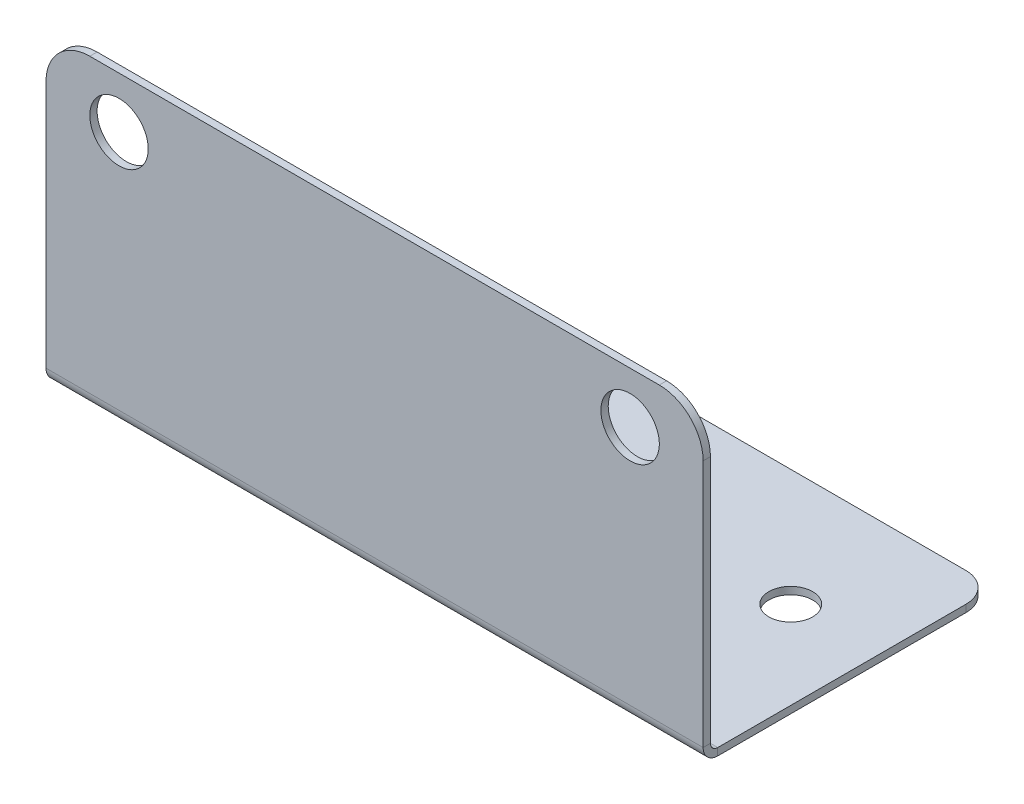
ISO-10303-21;
HEADER;
FILE_DESCRIPTION(('STEP AP214'),'2;1');
FILE_NAME('part.step','',(''),(''),'','','');
FILE_SCHEMA(('AUTOMOTIVE_DESIGN { 1 0 10303 214 1 1 1 1 }'));
ENDSEC;
DATA;
#1=APPLICATION_CONTEXT('core data for automotive mechanical design processes');
#2=APPLICATION_PROTOCOL_DEFINITION('international standard','automotive_design',2000,#1);
#3=PRODUCT_CONTEXT('',#1,'mechanical');
#4=PRODUCT('Part','Part','',(#3));
#5=PRODUCT_RELATED_PRODUCT_CATEGORY('part','',(#4));
#6=PRODUCT_DEFINITION_FORMATION('','',#4);
#7=PRODUCT_DEFINITION_CONTEXT('part definition',#1,'design');
#8=PRODUCT_DEFINITION('design','',#6,#7);
#9=PRODUCT_DEFINITION_SHAPE('','',#8);
#10=(LENGTH_UNIT() NAMED_UNIT(*) SI_UNIT(.MILLI.,.METRE.));
#11=(NAMED_UNIT(*) PLANE_ANGLE_UNIT() SI_UNIT($,.RADIAN.));
#12=(NAMED_UNIT(*) SI_UNIT($,.STERADIAN.) SOLID_ANGLE_UNIT());
#13=UNCERTAINTY_MEASURE_WITH_UNIT(LENGTH_MEASURE(1.E-05),#10,'distance_accuracy_value','');
#14=(GEOMETRIC_REPRESENTATION_CONTEXT(3) GLOBAL_UNCERTAINTY_ASSIGNED_CONTEXT((#13)) GLOBAL_UNIT_ASSIGNED_CONTEXT((#10,
#11,#12)) REPRESENTATION_CONTEXT('',''));
#15=CARTESIAN_POINT('',(0.,0.,0.));
#16=DIRECTION('',(0.,0.,1.));
#17=DIRECTION('',(1.,0.,0.));
#18=AXIS2_PLACEMENT_3D('',#15,#16,#17);
#19=CARTESIAN_POINT('',(22.5,0.5,-10.));
#20=DIRECTION('',(1.,0.,0.));
#21=DIRECTION('',(0.,0.,-1.));
#22=AXIS2_PLACEMENT_3D('',#19,#20,#21);
#23=PLANE('',#22);
#24=DIRECTION('',(0.,0.,1.));
#25=VECTOR('',#24,1.);
#26=CARTESIAN_POINT('',(22.5,0.,0.));
#27=LINE('',#26,#25);
#28=CARTESIAN_POINT('',(22.5,0.,9.));
#29=VERTEX_POINT('',#28);
#30=CARTESIAN_POINT('',(22.5,0.,-8.));
#31=VERTEX_POINT('',#30);
#32=EDGE_CURVE('E233',#29,#31,#27,.F.);
#33=ORIENTED_EDGE('',*,*,#32,.T.);
#34=DIRECTION('',(0.,1.,0.));
#35=VECTOR('',#34,1.);
#36=CARTESIAN_POINT('',(22.5,0.5,-8.));
#37=LINE('',#36,#35);
#38=CARTESIAN_POINT('',(22.5,0.5,-8.));
#39=VERTEX_POINT('',#38);
#40=EDGE_CURVE('E267',#31,#39,#37,.T.);
#41=ORIENTED_EDGE('',*,*,#40,.T.);
#42=DIRECTION('',(0.,0.,-1.));
#43=VECTOR('',#42,1.);
#44=CARTESIAN_POINT('',(22.5,0.5,-10.));
#45=LINE('',#44,#43);
#46=CARTESIAN_POINT('',(22.5,0.5,9.));
#47=VERTEX_POINT('',#46);
#48=EDGE_CURVE('E235',#47,#39,#45,.T.);
#49=ORIENTED_EDGE('',*,*,#48,.F.);
#50=DIRECTION('',(0.,-1.,0.));
#51=VECTOR('',#50,1.);
#52=CARTESIAN_POINT('',(22.5,0.499999999999999,9.));
#53=LINE('',#52,#51);
#54=EDGE_CURVE('E219',#47,#29,#53,.T.);
#55=ORIENTED_EDGE('',*,*,#54,.T.);
#56=EDGE_LOOP('',(#33,#41,#49,#55));
#57=FACE_BOUND('',#56,.T.);
#58=ADVANCED_FACE('F59',(#57),#23,.T.);
#59=CARTESIAN_POINT('',(0.,0.5,0.));
#60=DIRECTION('',(0.,1.,0.));
#61=DIRECTION('',(0.,0.,1.));
#62=AXIS2_PLACEMENT_3D('',#59,#60,#61);
#63=PLANE('',#62);
#64=CARTESIAN_POINT('',(16.5,0.5,-2.));
#65=DIRECTION('',(0.,1.,0.));
#66=DIRECTION('',(0.,0.,-1.));
#67=AXIS2_PLACEMENT_3D('',#64,#65,#66);
#68=CIRCLE('',#67,1.5);
#69=CARTESIAN_POINT('',(16.5,0.5,-3.5));
#70=VERTEX_POINT('',#69);
#71=EDGE_CURVE('E369',#70,#70,#68,.T.);
#72=ORIENTED_EDGE('',*,*,#71,.F.);
#73=EDGE_LOOP('',(#72));
#74=FACE_BOUND('',#73,.T.);
#75=CARTESIAN_POINT('',(-16.5,0.5,-2.));
#76=DIRECTION('',(0.,1.,0.));
#77=DIRECTION('',(0.,0.,1.));
#78=AXIS2_PLACEMENT_3D('',#75,#76,#77);
#79=CIRCLE('',#78,1.5);
#80=CARTESIAN_POINT('',(-16.5,0.5,-0.499999999999999));
#81=VERTEX_POINT('',#80);
#82=EDGE_CURVE('E363',#81,#81,#79,.T.);
#83=ORIENTED_EDGE('',*,*,#82,.F.);
#84=EDGE_LOOP('',(#83));
#85=FACE_BOUND('',#84,.T.);
#86=ORIENTED_EDGE('',*,*,#48,.T.);
#87=CARTESIAN_POINT('',(20.5,0.5,-8.));
#88=DIRECTION('',(0.,1.,0.));
#89=DIRECTION('',(0.,0.,1.));
#90=AXIS2_PLACEMENT_3D('',#87,#88,#89);
#91=CIRCLE('',#90,2.);
#92=CARTESIAN_POINT('',(20.5,0.5,-10.));
#93=VERTEX_POINT('',#92);
#94=EDGE_CURVE('E272',#39,#93,#91,.T.);
#95=ORIENTED_EDGE('',*,*,#94,.T.);
#96=DIRECTION('',(-1.,0.,0.));
#97=VECTOR('',#96,1.);
#98=CARTESIAN_POINT('',(-22.5,0.5,-10.));
#99=LINE('',#98,#97);
#100=CARTESIAN_POINT('',(-20.5,0.5,-10.));
#101=VERTEX_POINT('',#100);
#102=EDGE_CURVE('E238',#93,#101,#99,.T.);
#103=ORIENTED_EDGE('',*,*,#102,.T.);
#104=CARTESIAN_POINT('',(-20.5,0.5,-8.));
#105=DIRECTION('',(0.,1.,0.));
#106=DIRECTION('',(0.,0.,1.));
#107=AXIS2_PLACEMENT_3D('',#104,#105,#106);
#108=CIRCLE('',#107,2.);
#109=CARTESIAN_POINT('',(-22.5,0.5,-8.));
#110=VERTEX_POINT('',#109);
#111=EDGE_CURVE('E270',#101,#110,#108,.T.);
#112=ORIENTED_EDGE('',*,*,#111,.T.);
#113=DIRECTION('',(0.,0.,1.));
#114=VECTOR('',#113,1.);
#115=CARTESIAN_POINT('',(-22.5,0.5,-10.));
#116=LINE('',#115,#114);
#117=CARTESIAN_POINT('',(-22.5,0.5,9.));
#118=VERTEX_POINT('',#117);
#119=EDGE_CURVE('E242',#110,#118,#116,.T.);
#120=ORIENTED_EDGE('',*,*,#119,.T.);
#121=DIRECTION('',(1.,0.,0.));
#122=VECTOR('',#121,1.);
#123=CARTESIAN_POINT('',(22.5,0.499999999999999,9.));
#124=LINE('',#123,#122);
#125=CARTESIAN_POINT('',(-5.5,0.499999999999999,9.));
#126=VERTEX_POINT('',#125);
#127=EDGE_CURVE('E226',#126,#118,#124,.F.);
#128=ORIENTED_EDGE('',*,*,#127,.F.);
#129=CARTESIAN_POINT('',(-5.5,0.5,6.5));
#130=DIRECTION('',(0.,1.,0.));
#131=DIRECTION('',(0.,0.,1.));
#132=AXIS2_PLACEMENT_3D('',#129,#130,#131);
#133=CIRCLE('',#132,2.5);
#134=CARTESIAN_POINT('',(-5.5,0.5,4.));
#135=VERTEX_POINT('',#134);
#136=EDGE_CURVE('E179',#135,#126,#133,.T.);
#137=ORIENTED_EDGE('',*,*,#136,.F.);
#138=DIRECTION('',(-1.,0.,0.));
#139=VECTOR('',#138,1.);
#140=CARTESIAN_POINT('',(-5.5,0.5,4.));
#141=LINE('',#140,#139);
#142=CARTESIAN_POINT('',(5.5,0.5,4.));
#143=VERTEX_POINT('',#142);
#144=EDGE_CURVE('E202',#143,#135,#141,.T.);
#145=ORIENTED_EDGE('',*,*,#144,.F.);
#146=CARTESIAN_POINT('',(5.5,0.5,6.49999999999999));
#147=DIRECTION('',(0.,1.,0.));
#148=DIRECTION('',(0.,0.,1.));
#149=AXIS2_PLACEMENT_3D('',#146,#147,#148);
#150=CIRCLE('',#149,2.5);
#151=CARTESIAN_POINT('',(5.5,0.5,8.99999999999999));
#152=VERTEX_POINT('',#151);
#153=EDGE_CURVE('E354',#152,#143,#150,.T.);
#154=ORIENTED_EDGE('',*,*,#153,.F.);
#155=EDGE_CURVE('E223',#47,#152,#124,.F.);
#156=ORIENTED_EDGE('',*,*,#155,.F.);
#157=EDGE_LOOP('',(#86,#95,#103,#112,#120,#128,#137,#145,#154,#156));
#158=FACE_BOUND('',#157,.T.);
#159=ADVANCED_FACE('F290',(#74,#85,#158),#63,.T.);
#160=CARTESIAN_POINT('',(0.,0.,0.));
#161=DIRECTION('',(0.,1.,0.));
#162=DIRECTION('',(0.,0.,1.));
#163=AXIS2_PLACEMENT_3D('',#160,#161,#162);
#164=PLANE('',#163);
#165=CARTESIAN_POINT('',(16.5,0.,-2.));
#166=DIRECTION('',(0.,1.,0.));
#167=DIRECTION('',(0.,0.,-1.));
#168=AXIS2_PLACEMENT_3D('',#165,#166,#167);
#169=CIRCLE('',#168,1.5);
#170=CARTESIAN_POINT('',(16.5,0.,-3.5));
#171=VERTEX_POINT('',#170);
#172=EDGE_CURVE('E366',#171,#171,#169,.T.);
#173=ORIENTED_EDGE('',*,*,#172,.T.);
#174=EDGE_LOOP('',(#173));
#175=FACE_BOUND('',#174,.T.);
#176=CARTESIAN_POINT('',(-16.5,0.,-2.));
#177=DIRECTION('',(0.,1.,0.));
#178=DIRECTION('',(0.,0.,1.));
#179=AXIS2_PLACEMENT_3D('',#176,#177,#178);
#180=CIRCLE('',#179,1.5);
#181=CARTESIAN_POINT('',(-16.5,0.,-0.499999999999999));
#182=VERTEX_POINT('',#181);
#183=EDGE_CURVE('E360',#182,#182,#180,.T.);
#184=ORIENTED_EDGE('',*,*,#183,.T.);
#185=EDGE_LOOP('',(#184));
#186=FACE_BOUND('',#185,.T.);
#187=DIRECTION('',(1.,0.,0.));
#188=VECTOR('',#187,1.);
#189=CARTESIAN_POINT('',(0.,0.,-10.));
#190=LINE('',#189,#188);
#191=CARTESIAN_POINT('',(20.5,0.,-10.));
#192=VERTEX_POINT('',#191);
#193=CARTESIAN_POINT('',(-20.5,0.,-10.));
#194=VERTEX_POINT('',#193);
#195=EDGE_CURVE('E247',#192,#194,#190,.F.);
#196=ORIENTED_EDGE('',*,*,#195,.F.);
#197=CARTESIAN_POINT('',(20.5,0.,-8.));
#198=DIRECTION('',(0.,1.,0.));
#199=DIRECTION('',(0.,0.,1.));
#200=AXIS2_PLACEMENT_3D('',#197,#198,#199);
#201=CIRCLE('',#200,2.);
#202=EDGE_CURVE('E67',#192,#31,#201,.F.);
#203=ORIENTED_EDGE('',*,*,#202,.T.);
#204=ORIENTED_EDGE('',*,*,#32,.F.);
#205=DIRECTION('',(1.,0.,0.));
#206=VECTOR('',#205,1.);
#207=CARTESIAN_POINT('',(22.5,0.,9.));
#208=LINE('',#207,#206);
#209=CARTESIAN_POINT('',(5.5,0.,9.));
#210=VERTEX_POINT('',#209);
#211=EDGE_CURVE('E209',#29,#210,#208,.F.);
#212=ORIENTED_EDGE('',*,*,#211,.T.);
#213=CARTESIAN_POINT('',(5.5,0.,6.49999999999999));
#214=DIRECTION('',(0.,1.,0.));
#215=DIRECTION('',(0.,0.,1.));
#216=AXIS2_PLACEMENT_3D('',#213,#214,#215);
#217=CIRCLE('',#216,2.5);
#218=CARTESIAN_POINT('',(5.5,0.,4.));
#219=VERTEX_POINT('',#218);
#220=EDGE_CURVE('E194',#210,#219,#217,.T.);
#221=ORIENTED_EDGE('',*,*,#220,.T.);
#222=DIRECTION('',(-1.,0.,0.));
#223=VECTOR('',#222,1.);
#224=CARTESIAN_POINT('',(-5.5,0.,4.));
#225=LINE('',#224,#223);
#226=CARTESIAN_POINT('',(-5.5,0.,4.));
#227=VERTEX_POINT('',#226);
#228=EDGE_CURVE('E184',#219,#227,#225,.T.);
#229=ORIENTED_EDGE('',*,*,#228,.T.);
#230=CARTESIAN_POINT('',(-5.5,0.,6.5));
#231=DIRECTION('',(0.,1.,0.));
#232=DIRECTION('',(0.,0.,1.));
#233=AXIS2_PLACEMENT_3D('',#230,#231,#232);
#234=CIRCLE('',#233,2.5);
#235=CARTESIAN_POINT('',(-5.5,0.,9.));
#236=VERTEX_POINT('',#235);
#237=EDGE_CURVE('E176',#227,#236,#234,.T.);
#238=ORIENTED_EDGE('',*,*,#237,.T.);
#239=CARTESIAN_POINT('',(-22.5,0.,9.));
#240=VERTEX_POINT('',#239);
#241=EDGE_CURVE('E198',#236,#240,#208,.F.);
#242=ORIENTED_EDGE('',*,*,#241,.T.);
#243=DIRECTION('',(0.,0.,1.));
#244=VECTOR('',#243,1.);
#245=CARTESIAN_POINT('',(-22.5,0.,0.));
#246=LINE('',#245,#244);
#247=CARTESIAN_POINT('',(-22.5,0.,-8.));
#248=VERTEX_POINT('',#247);
#249=EDGE_CURVE('E239',#248,#240,#246,.T.);
#250=ORIENTED_EDGE('',*,*,#249,.F.);
#251=CARTESIAN_POINT('',(-20.5,0.,-8.));
#252=DIRECTION('',(0.,1.,0.));
#253=DIRECTION('',(0.,0.,1.));
#254=AXIS2_PLACEMENT_3D('',#251,#252,#253);
#255=CIRCLE('',#254,2.);
#256=EDGE_CURVE('E79',#248,#194,#255,.F.);
#257=ORIENTED_EDGE('',*,*,#256,.T.);
#258=EDGE_LOOP('',(#196,#203,#204,#212,#221,#229,#238,#242,#250,#257));
#259=FACE_BOUND('',#258,.T.);
#260=ADVANCED_FACE('F197',(#175,#186,#259),#164,.F.);
#261=CARTESIAN_POINT('',(-22.5,0.5,-10.));
#262=DIRECTION('',(-1.,0.,0.));
#263=DIRECTION('',(0.,0.,1.));
#264=AXIS2_PLACEMENT_3D('',#261,#262,#263);
#265=PLANE('',#264);
#266=ORIENTED_EDGE('',*,*,#119,.F.);
#267=DIRECTION('',(0.,1.,0.));
#268=VECTOR('',#267,1.);
#269=CARTESIAN_POINT('',(-22.5,0.5,-8.));
#270=LINE('',#269,#268);
#271=EDGE_CURVE('E13',#110,#248,#270,.F.);
#272=ORIENTED_EDGE('',*,*,#271,.T.);
#273=ORIENTED_EDGE('',*,*,#249,.T.);
#274=DIRECTION('',(0.,-1.,0.));
#275=VECTOR('',#274,1.);
#276=CARTESIAN_POINT('',(-22.5,0.499999999999999,9.));
#277=LINE('',#276,#275);
#278=EDGE_CURVE('E231',#118,#240,#277,.T.);
#279=ORIENTED_EDGE('',*,*,#278,.F.);
#280=EDGE_LOOP('',(#266,#272,#273,#279));
#281=FACE_BOUND('',#280,.T.);
#282=ADVANCED_FACE('F297',(#281),#265,.T.);
#283=CARTESIAN_POINT('',(-22.5,0.5,-10.));
#284=DIRECTION('',(0.,0.,-1.));
#285=DIRECTION('',(-1.,0.,0.));
#286=AXIS2_PLACEMENT_3D('',#283,#284,#285);
#287=PLANE('',#286);
#288=ORIENTED_EDGE('',*,*,#102,.F.);
#289=DIRECTION('',(0.,1.,0.));
#290=VECTOR('',#289,1.);
#291=CARTESIAN_POINT('',(20.5,0.5,-10.));
#292=LINE('',#291,#290);
#293=EDGE_CURVE('E277',#93,#192,#292,.F.);
#294=ORIENTED_EDGE('',*,*,#293,.T.);
#295=ORIENTED_EDGE('',*,*,#195,.T.);
#296=DIRECTION('',(0.,1.,0.));
#297=VECTOR('',#296,1.);
#298=CARTESIAN_POINT('',(-20.5,0.5,-10.));
#299=LINE('',#298,#297);
#300=EDGE_CURVE('E274',#194,#101,#299,.T.);
#301=ORIENTED_EDGE('',*,*,#300,.T.);
#302=EDGE_LOOP('',(#288,#294,#295,#301));
#303=FACE_BOUND('',#302,.T.);
#304=ADVANCED_FACE('F292',(#303),#287,.T.);
#305=CARTESIAN_POINT('',(-22.5,0.999999999999999,9.));
#306=DIRECTION('',(-1.,0.,0.));
#307=DIRECTION('',(0.,0.,1.));
#308=AXIS2_PLACEMENT_3D('',#305,#306,#307);
#309=PLANE('',#308);
#310=DIRECTION('',(0.,0.,-1.));
#311=VECTOR('',#310,1.);
#312=CARTESIAN_POINT('',(-22.5,0.999999999999999,10.));
#313=LINE('',#312,#311);
#314=CARTESIAN_POINT('',(-22.5,0.999999999999999,9.5));
#315=VERTEX_POINT('',#314);
#316=CARTESIAN_POINT('',(-22.5,0.999999999999999,10.));
#317=VERTEX_POINT('',#316);
#318=EDGE_CURVE('E217',#315,#317,#313,.F.);
#319=ORIENTED_EDGE('',*,*,#318,.F.);
#320=CARTESIAN_POINT('',(-22.5,0.999999999999999,9.));
#321=DIRECTION('',(1.,0.,0.));
#322=DIRECTION('',(0.,0.,-1.));
#323=AXIS2_PLACEMENT_3D('',#320,#321,#322);
#324=CIRCLE('',#323,0.5);
#325=EDGE_CURVE('E213',#118,#315,#324,.F.);
#326=ORIENTED_EDGE('',*,*,#325,.F.);
#327=ORIENTED_EDGE('',*,*,#278,.T.);
#328=CARTESIAN_POINT('',(-22.5,0.999999999999999,9.));
#329=DIRECTION('',(1.,0.,0.));
#330=DIRECTION('',(0.,0.,-1.));
#331=AXIS2_PLACEMENT_3D('',#328,#329,#330);
#332=CIRCLE('',#331,1.);
#333=EDGE_CURVE('E208',#240,#317,#332,.F.);
#334=ORIENTED_EDGE('',*,*,#333,.T.);
#335=EDGE_LOOP('',(#319,#326,#327,#334));
#336=FACE_BOUND('',#335,.T.);
#337=ADVANCED_FACE('F301',(#336),#309,.T.);
#338=CARTESIAN_POINT('',(22.5,0.999999999999999,9.));
#339=DIRECTION('',(-1.,0.,0.));
#340=DIRECTION('',(0.,0.,1.));
#341=AXIS2_PLACEMENT_3D('',#338,#339,#340);
#342=PLANE('',#341);
#343=CARTESIAN_POINT('',(22.5,0.999999999999999,9.));
#344=DIRECTION('',(1.,0.,0.));
#345=DIRECTION('',(0.,0.,-1.));
#346=AXIS2_PLACEMENT_3D('',#343,#344,#345);
#347=CIRCLE('',#346,0.5);
#348=CARTESIAN_POINT('',(22.5,0.999999999999999,9.5));
#349=VERTEX_POINT('',#348);
#350=EDGE_CURVE('E227',#349,#47,#347,.T.);
#351=ORIENTED_EDGE('',*,*,#350,.F.);
#352=DIRECTION('',(0.,0.,-1.));
#353=VECTOR('',#352,1.);
#354=CARTESIAN_POINT('',(22.5,0.999999999999999,9.5));
#355=LINE('',#354,#353);
#356=CARTESIAN_POINT('',(22.5,0.999999999999999,10.));
#357=VERTEX_POINT('',#356);
#358=EDGE_CURVE('E317',#349,#357,#355,.F.);
#359=ORIENTED_EDGE('',*,*,#358,.T.);
#360=CARTESIAN_POINT('',(22.5,0.999999999999999,9.));
#361=DIRECTION('',(1.,0.,0.));
#362=DIRECTION('',(0.,0.,-1.));
#363=AXIS2_PLACEMENT_3D('',#360,#361,#362);
#364=CIRCLE('',#363,1.);
#365=EDGE_CURVE('E210',#357,#29,#364,.T.);
#366=ORIENTED_EDGE('',*,*,#365,.T.);
#367=ORIENTED_EDGE('',*,*,#54,.F.);
#368=EDGE_LOOP('',(#351,#359,#366,#367));
#369=FACE_BOUND('',#368,.T.);
#370=ADVANCED_FACE('F463',(#369),#342,.F.);
#371=CARTESIAN_POINT('',(22.5,0.999999999999999,9.));
#372=DIRECTION('',(1.,0.,0.));
#373=DIRECTION('',(0.,0.,1.));
#374=AXIS2_PLACEMENT_3D('',#371,#372,#373);
#375=CYLINDRICAL_SURFACE('',#374,1.);
#376=ORIENTED_EDGE('',*,*,#211,.F.);
#377=ORIENTED_EDGE('',*,*,#365,.F.);
#378=DIRECTION('',(1.,0.,0.));
#379=VECTOR('',#378,1.);
#380=CARTESIAN_POINT('',(-22.5,0.999999999999999,10.));
#381=LINE('',#380,#379);
#382=EDGE_CURVE('E319',#357,#317,#381,.F.);
#383=ORIENTED_EDGE('',*,*,#382,.T.);
#384=ORIENTED_EDGE('',*,*,#333,.F.);
#385=ORIENTED_EDGE('',*,*,#241,.F.);
#386=DIRECTION('',(1.,0.,0.));
#387=VECTOR('',#386,1.);
#388=CARTESIAN_POINT('',(-5.5,0.,9.));
#389=LINE('',#388,#387);
#390=EDGE_CURVE('E188',#236,#210,#389,.T.);
#391=ORIENTED_EDGE('',*,*,#390,.T.);
#392=EDGE_LOOP('',(#376,#377,#383,#384,#385,#391));
#393=FACE_BOUND('',#392,.T.);
#394=ADVANCED_FACE('F205',(#393),#375,.T.);
#395=CARTESIAN_POINT('',(22.5,0.999999999999999,9.));
#396=DIRECTION('',(1.,0.,0.));
#397=DIRECTION('',(0.,0.,1.));
#398=AXIS2_PLACEMENT_3D('',#395,#396,#397);
#399=CYLINDRICAL_SURFACE('',#398,0.5);
#400=ORIENTED_EDGE('',*,*,#155,.T.);
#401=DIRECTION('',(1.,0.,0.));
#402=VECTOR('',#401,1.);
#403=CARTESIAN_POINT('',(-5.5,0.5,9.));
#404=LINE('',#403,#402);
#405=EDGE_CURVE('E357',#126,#152,#404,.T.);
#406=ORIENTED_EDGE('',*,*,#405,.F.);
#407=ORIENTED_EDGE('',*,*,#127,.T.);
#408=ORIENTED_EDGE('',*,*,#325,.T.);
#409=DIRECTION('',(1.,0.,0.));
#410=VECTOR('',#409,1.);
#411=CARTESIAN_POINT('',(-22.5,0.999999999999999,9.5));
#412=LINE('',#411,#410);
#413=EDGE_CURVE('E306',#315,#349,#412,.T.);
#414=ORIENTED_EDGE('',*,*,#413,.T.);
#415=ORIENTED_EDGE('',*,*,#350,.T.);
#416=EDGE_LOOP('',(#400,#406,#407,#408,#414,#415));
#417=FACE_BOUND('',#416,.T.);
#418=ADVANCED_FACE('F305',(#417),#399,.F.);
#419=CARTESIAN_POINT('',(-22.5,0.5,10.));
#420=DIRECTION('',(1.,0.,0.));
#421=DIRECTION('',(0.,0.,-1.));
#422=AXIS2_PLACEMENT_3D('',#419,#420,#421);
#423=PLANE('',#422);
#424=DIRECTION('',(0.,-1.,0.));
#425=VECTOR('',#424,1.);
#426=CARTESIAN_POINT('',(-22.5,0.,10.));
#427=LINE('',#426,#425);
#428=CARTESIAN_POINT('',(-22.5,18.,10.));
#429=VERTEX_POINT('',#428);
#430=EDGE_CURVE('E329',#429,#317,#427,.T.);
#431=ORIENTED_EDGE('',*,*,#430,.F.);
#432=DIRECTION('',(0.,0.,-1.));
#433=VECTOR('',#432,1.);
#434=CARTESIAN_POINT('',(-22.5,18.,10.));
#435=LINE('',#434,#433);
#436=CARTESIAN_POINT('',(-22.5,18.,9.5));
#437=VERTEX_POINT('',#436);
#438=EDGE_CURVE('E264',#429,#437,#435,.T.);
#439=ORIENTED_EDGE('',*,*,#438,.T.);
#440=DIRECTION('',(0.,1.,0.));
#441=VECTOR('',#440,1.);
#442=CARTESIAN_POINT('',(-22.5,0.5,9.5));
#443=LINE('',#442,#441);
#444=EDGE_CURVE('E314',#437,#315,#443,.F.);
#445=ORIENTED_EDGE('',*,*,#444,.T.);
#446=ORIENTED_EDGE('',*,*,#318,.T.);
#447=EDGE_LOOP('',(#431,#439,#445,#446));
#448=FACE_BOUND('',#447,.T.);
#449=ADVANCED_FACE('F489',(#448),#423,.F.);
#450=CARTESIAN_POINT('',(22.5,21.,10.));
#451=DIRECTION('',(-1.,0.,0.));
#452=DIRECTION('',(0.,-1.,0.));
#453=AXIS2_PLACEMENT_3D('',#450,#451,#452);
#454=PLANE('',#453);
#455=DIRECTION('',(0.,-1.,0.));
#456=VECTOR('',#455,1.);
#457=CARTESIAN_POINT('',(22.5,21.,9.5));
#458=LINE('',#457,#456);
#459=CARTESIAN_POINT('',(22.5,18.,9.5));
#460=VERTEX_POINT('',#459);
#461=EDGE_CURVE('E316',#349,#460,#458,.F.);
#462=ORIENTED_EDGE('',*,*,#461,.T.);
#463=DIRECTION('',(0.,0.,-1.));
#464=VECTOR('',#463,1.);
#465=CARTESIAN_POINT('',(22.5,18.,10.));
#466=LINE('',#465,#464);
#467=CARTESIAN_POINT('',(22.5,18.,10.));
#468=VERTEX_POINT('',#467);
#469=EDGE_CURVE('E258',#460,#468,#466,.F.);
#470=ORIENTED_EDGE('',*,*,#469,.T.);
#471=DIRECTION('',(0.,1.,0.));
#472=VECTOR('',#471,1.);
#473=CARTESIAN_POINT('',(22.5,0.,10.));
#474=LINE('',#473,#472);
#475=EDGE_CURVE('E331',#357,#468,#474,.T.);
#476=ORIENTED_EDGE('',*,*,#475,.F.);
#477=ORIENTED_EDGE('',*,*,#358,.F.);
#478=EDGE_LOOP('',(#462,#470,#476,#477));
#479=FACE_BOUND('',#478,.T.);
#480=ADVANCED_FACE('F498',(#479),#454,.F.);
#481=CARTESIAN_POINT('',(0.,0.,10.));
#482=DIRECTION('',(0.,0.,-1.));
#483=DIRECTION('',(-1.,0.,0.));
#484=AXIS2_PLACEMENT_3D('',#481,#482,#483);
#485=PLANE('',#484);
#486=CARTESIAN_POINT('',(17.5,17.5,10.));
#487=DIRECTION('',(0.,0.,1.));
#488=DIRECTION('',(-1.,0.,0.));
#489=AXIS2_PLACEMENT_3D('',#486,#487,#488);
#490=CIRCLE('',#489,2.00000000000001);
#491=CARTESIAN_POINT('',(15.5,17.5,10.));
#492=VERTEX_POINT('',#491);
#493=EDGE_CURVE('E342',#492,#492,#490,.T.);
#494=ORIENTED_EDGE('',*,*,#493,.F.);
#495=EDGE_LOOP('',(#494));
#496=FACE_BOUND('',#495,.T.);
#497=CARTESIAN_POINT('',(-17.5,17.5,10.));
#498=DIRECTION('',(0.,0.,1.));
#499=DIRECTION('',(1.,0.,0.));
#500=AXIS2_PLACEMENT_3D('',#497,#498,#499);
#501=CIRCLE('',#500,2.);
#502=CARTESIAN_POINT('',(-15.5,17.5,10.));
#503=VERTEX_POINT('',#502);
#504=EDGE_CURVE('E336',#503,#503,#501,.T.);
#505=ORIENTED_EDGE('',*,*,#504,.F.);
#506=EDGE_LOOP('',(#505));
#507=FACE_BOUND('',#506,.T.);
#508=ORIENTED_EDGE('',*,*,#475,.T.);
#509=CARTESIAN_POINT('',(19.5,18.,10.));
#510=DIRECTION('',(0.,0.,-1.));
#511=DIRECTION('',(-1.,0.,0.));
#512=AXIS2_PLACEMENT_3D('',#509,#510,#511);
#513=CIRCLE('',#512,3.);
#514=CARTESIAN_POINT('',(19.5,21.,10.));
#515=VERTEX_POINT('',#514);
#516=EDGE_CURVE('E262',#468,#515,#513,.F.);
#517=ORIENTED_EDGE('',*,*,#516,.T.);
#518=DIRECTION('',(-1.,0.,0.));
#519=VECTOR('',#518,1.);
#520=CARTESIAN_POINT('',(0.,21.,10.));
#521=LINE('',#520,#519);
#522=CARTESIAN_POINT('',(-19.5,21.,10.));
#523=VERTEX_POINT('',#522);
#524=EDGE_CURVE('E230',#515,#523,#521,.T.);
#525=ORIENTED_EDGE('',*,*,#524,.T.);
#526=CARTESIAN_POINT('',(-19.5,18.,10.));
#527=DIRECTION('',(0.,0.,-1.));
#528=DIRECTION('',(-1.,0.,0.));
#529=AXIS2_PLACEMENT_3D('',#526,#527,#528);
#530=CIRCLE('',#529,3.);
#531=EDGE_CURVE('E260',#523,#429,#530,.F.);
#532=ORIENTED_EDGE('',*,*,#531,.T.);
#533=ORIENTED_EDGE('',*,*,#430,.T.);
#534=ORIENTED_EDGE('',*,*,#382,.F.);
#535=EDGE_LOOP('',(#508,#517,#525,#532,#533,#534));
#536=FACE_BOUND('',#535,.T.);
#537=ADVANCED_FACE('F508',(#496,#507,#536),#485,.F.);
#538=CARTESIAN_POINT('',(0.,0.,9.5));
#539=DIRECTION('',(0.,0.,-1.));
#540=DIRECTION('',(-1.,0.,0.));
#541=AXIS2_PLACEMENT_3D('',#538,#539,#540);
#542=PLANE('',#541);
#543=CARTESIAN_POINT('',(17.5,17.5,9.5));
#544=DIRECTION('',(0.,0.,1.));
#545=DIRECTION('',(-1.,0.,0.));
#546=AXIS2_PLACEMENT_3D('',#543,#544,#545);
#547=CIRCLE('',#546,2.00000000000001);
#548=CARTESIAN_POINT('',(15.5,17.5,9.5));
#549=VERTEX_POINT('',#548);
#550=EDGE_CURVE('E339',#549,#549,#547,.T.);
#551=ORIENTED_EDGE('',*,*,#550,.T.);
#552=EDGE_LOOP('',(#551));
#553=FACE_BOUND('',#552,.T.);
#554=CARTESIAN_POINT('',(-17.5,17.5,9.5));
#555=DIRECTION('',(0.,0.,1.));
#556=DIRECTION('',(1.,0.,0.));
#557=AXIS2_PLACEMENT_3D('',#554,#555,#556);
#558=CIRCLE('',#557,2.);
#559=CARTESIAN_POINT('',(-15.5,17.5,9.5));
#560=VERTEX_POINT('',#559);
#561=EDGE_CURVE('E321',#560,#560,#558,.T.);
#562=ORIENTED_EDGE('',*,*,#561,.T.);
#563=EDGE_LOOP('',(#562));
#564=FACE_BOUND('',#563,.T.);
#565=DIRECTION('',(1.,0.,0.));
#566=VECTOR('',#565,1.);
#567=CARTESIAN_POINT('',(-22.5,21.,9.5));
#568=LINE('',#567,#566);
#569=CARTESIAN_POINT('',(19.5,21.,9.5));
#570=VERTEX_POINT('',#569);
#571=CARTESIAN_POINT('',(-19.5,21.,9.5));
#572=VERTEX_POINT('',#571);
#573=EDGE_CURVE('E326',#570,#572,#568,.F.);
#574=ORIENTED_EDGE('',*,*,#573,.F.);
#575=CARTESIAN_POINT('',(19.5,18.,9.5));
#576=DIRECTION('',(0.,0.,-1.));
#577=DIRECTION('',(-1.,0.,0.));
#578=AXIS2_PLACEMENT_3D('',#575,#576,#577);
#579=CIRCLE('',#578,3.);
#580=EDGE_CURVE('E256',#570,#460,#579,.T.);
#581=ORIENTED_EDGE('',*,*,#580,.T.);
#582=ORIENTED_EDGE('',*,*,#461,.F.);
#583=ORIENTED_EDGE('',*,*,#413,.F.);
#584=ORIENTED_EDGE('',*,*,#444,.F.);
#585=CARTESIAN_POINT('',(-19.5,18.,9.5));
#586=DIRECTION('',(0.,0.,-1.));
#587=DIRECTION('',(-1.,0.,0.));
#588=AXIS2_PLACEMENT_3D('',#585,#586,#587);
#589=CIRCLE('',#588,3.);
#590=EDGE_CURVE('E254',#437,#572,#589,.T.);
#591=ORIENTED_EDGE('',*,*,#590,.T.);
#592=EDGE_LOOP('',(#574,#581,#582,#583,#584,#591));
#593=FACE_BOUND('',#592,.T.);
#594=ADVANCED_FACE('F313',(#553,#564,#593),#542,.T.);
#595=CARTESIAN_POINT('',(-22.5,21.,10.));
#596=DIRECTION('',(0.,-1.,0.));
#597=DIRECTION('',(0.,0.,-1.));
#598=AXIS2_PLACEMENT_3D('',#595,#596,#597);
#599=PLANE('',#598);
#600=ORIENTED_EDGE('',*,*,#524,.F.);
#601=DIRECTION('',(0.,0.,-1.));
#602=VECTOR('',#601,1.);
#603=CARTESIAN_POINT('',(19.5,21.,10.));
#604=LINE('',#603,#602);
#605=EDGE_CURVE('E251',#515,#570,#604,.T.);
#606=ORIENTED_EDGE('',*,*,#605,.T.);
#607=ORIENTED_EDGE('',*,*,#573,.T.);
#608=DIRECTION('',(0.,0.,-1.));
#609=VECTOR('',#608,1.);
#610=CARTESIAN_POINT('',(-19.5,21.,10.));
#611=LINE('',#610,#609);
#612=EDGE_CURVE('E244',#572,#523,#611,.F.);
#613=ORIENTED_EDGE('',*,*,#612,.T.);
#614=EDGE_LOOP('',(#600,#606,#607,#613));
#615=FACE_BOUND('',#614,.T.);
#616=ADVANCED_FACE('F527',(#615),#599,.F.);
#617=CARTESIAN_POINT('',(-17.5,17.5,9.5));
#618=DIRECTION('',(0.,0.,1.));
#619=DIRECTION('',(1.,0.,0.));
#620=AXIS2_PLACEMENT_3D('',#617,#618,#619);
#621=CYLINDRICAL_SURFACE('',#620,2.);
#622=ORIENTED_EDGE('',*,*,#561,.F.);
#623=EDGE_LOOP('',(#622));
#624=FACE_BOUND('',#623,.T.);
#625=ORIENTED_EDGE('',*,*,#504,.T.);
#626=EDGE_LOOP('',(#625));
#627=FACE_BOUND('',#626,.T.);
#628=ADVANCED_FACE('F537',(#624,#627),#621,.F.);
#629=CARTESIAN_POINT('',(17.5,17.5,9.5));
#630=DIRECTION('',(0.,0.,1.));
#631=DIRECTION('',(1.,0.,0.));
#632=AXIS2_PLACEMENT_3D('',#629,#630,#631);
#633=CYLINDRICAL_SURFACE('',#632,2.00000000000001);
#634=ORIENTED_EDGE('',*,*,#550,.F.);
#635=EDGE_LOOP('',(#634));
#636=FACE_BOUND('',#635,.T.);
#637=ORIENTED_EDGE('',*,*,#493,.T.);
#638=EDGE_LOOP('',(#637));
#639=FACE_BOUND('',#638,.T.);
#640=ADVANCED_FACE('F547',(#636,#639),#633,.F.);
#641=CARTESIAN_POINT('',(-5.5,0.,6.5));
#642=DIRECTION('',(0.,1.,0.));
#643=DIRECTION('',(0.,0.,1.));
#644=AXIS2_PLACEMENT_3D('',#641,#642,#643);
#645=CYLINDRICAL_SURFACE('',#644,2.5);
#646=ORIENTED_EDGE('',*,*,#136,.T.);
#647=DIRECTION('',(0.,1.,0.));
#648=VECTOR('',#647,1.);
#649=CARTESIAN_POINT('',(-5.5,0.,9.));
#650=LINE('',#649,#648);
#651=EDGE_CURVE('E172',#236,#126,#650,.T.);
#652=ORIENTED_EDGE('',*,*,#651,.F.);
#653=ORIENTED_EDGE('',*,*,#237,.F.);
#654=DIRECTION('',(0.,1.,0.));
#655=VECTOR('',#654,1.);
#656=CARTESIAN_POINT('',(-5.5,0.,4.));
#657=LINE('',#656,#655);
#658=EDGE_CURVE('E345',#227,#135,#657,.T.);
#659=ORIENTED_EDGE('',*,*,#658,.T.);
#660=EDGE_LOOP('',(#646,#652,#653,#659));
#661=FACE_BOUND('',#660,.T.);
#662=ADVANCED_FACE('F174',(#661),#645,.F.);
#663=CARTESIAN_POINT('',(-5.5,0.,4.));
#664=DIRECTION('',(0.,0.,-1.));
#665=DIRECTION('',(-1.,0.,0.));
#666=AXIS2_PLACEMENT_3D('',#663,#664,#665);
#667=PLANE('',#666);
#668=ORIENTED_EDGE('',*,*,#144,.T.);
#669=ORIENTED_EDGE('',*,*,#658,.F.);
#670=ORIENTED_EDGE('',*,*,#228,.F.);
#671=DIRECTION('',(0.,1.,0.));
#672=VECTOR('',#671,1.);
#673=CARTESIAN_POINT('',(5.5,0.,4.));
#674=LINE('',#673,#672);
#675=EDGE_CURVE('E349',#219,#143,#674,.T.);
#676=ORIENTED_EDGE('',*,*,#675,.T.);
#677=EDGE_LOOP('',(#668,#669,#670,#676));
#678=FACE_BOUND('',#677,.T.);
#679=ADVANCED_FACE('F566',(#678),#667,.F.);
#680=CARTESIAN_POINT('',(5.5,0.,6.49999999999999));
#681=DIRECTION('',(0.,1.,0.));
#682=DIRECTION('',(0.,0.,1.));
#683=AXIS2_PLACEMENT_3D('',#680,#681,#682);
#684=CYLINDRICAL_SURFACE('',#683,2.5);
#685=ORIENTED_EDGE('',*,*,#153,.T.);
#686=ORIENTED_EDGE('',*,*,#675,.F.);
#687=ORIENTED_EDGE('',*,*,#220,.F.);
#688=DIRECTION('',(0.,1.,0.));
#689=VECTOR('',#688,1.);
#690=CARTESIAN_POINT('',(5.5,0.,8.99999999999999));
#691=LINE('',#690,#689);
#692=EDGE_CURVE('E183',#210,#152,#691,.T.);
#693=ORIENTED_EDGE('',*,*,#692,.T.);
#694=EDGE_LOOP('',(#685,#686,#687,#693));
#695=FACE_BOUND('',#694,.T.);
#696=ADVANCED_FACE('F396',(#695),#684,.F.);
#697=CARTESIAN_POINT('',(-5.5,0.,9.));
#698=DIRECTION('',(0.,0.,1.));
#699=DIRECTION('',(1.,0.,0.));
#700=AXIS2_PLACEMENT_3D('',#697,#698,#699);
#701=PLANE('',#700);
#702=ORIENTED_EDGE('',*,*,#405,.T.);
#703=ORIENTED_EDGE('',*,*,#692,.F.);
#704=ORIENTED_EDGE('',*,*,#390,.F.);
#705=ORIENTED_EDGE('',*,*,#651,.T.);
#706=EDGE_LOOP('',(#702,#703,#704,#705));
#707=FACE_BOUND('',#706,.T.);
#708=ADVANCED_FACE('F189',(#707),#701,.F.);
#709=CARTESIAN_POINT('',(-16.5,0.,-2.));
#710=DIRECTION('',(0.,1.,0.));
#711=DIRECTION('',(0.,0.,1.));
#712=AXIS2_PLACEMENT_3D('',#709,#710,#711);
#713=CYLINDRICAL_SURFACE('',#712,1.5);
#714=ORIENTED_EDGE('',*,*,#183,.F.);
#715=EDGE_LOOP('',(#714));
#716=FACE_BOUND('',#715,.T.);
#717=ORIENTED_EDGE('',*,*,#82,.T.);
#718=EDGE_LOOP('',(#717));
#719=FACE_BOUND('',#718,.T.);
#720=ADVANCED_FACE('F381',(#716,#719),#713,.F.);
#721=CARTESIAN_POINT('',(16.5,0.,-2.));
#722=DIRECTION('',(0.,1.,0.));
#723=DIRECTION('',(0.,0.,1.));
#724=AXIS2_PLACEMENT_3D('',#721,#722,#723);
#725=CYLINDRICAL_SURFACE('',#724,1.5);
#726=ORIENTED_EDGE('',*,*,#172,.F.);
#727=EDGE_LOOP('',(#726));
#728=FACE_BOUND('',#727,.T.);
#729=ORIENTED_EDGE('',*,*,#71,.T.);
#730=EDGE_LOOP('',(#729));
#731=FACE_BOUND('',#730,.T.);
#732=ADVANCED_FACE('F377',(#728,#731),#725,.F.);
#733=CARTESIAN_POINT('',(19.5,18.,10.));
#734=DIRECTION('',(0.,0.,-1.));
#735=DIRECTION('',(-1.,0.,0.));
#736=AXIS2_PLACEMENT_3D('',#733,#734,#735);
#737=CYLINDRICAL_SURFACE('',#736,3.);
#738=ORIENTED_EDGE('',*,*,#516,.F.);
#739=ORIENTED_EDGE('',*,*,#469,.F.);
#740=ORIENTED_EDGE('',*,*,#580,.F.);
#741=ORIENTED_EDGE('',*,*,#605,.F.);
#742=EDGE_LOOP('',(#738,#739,#740,#741));
#743=FACE_BOUND('',#742,.T.);
#744=ADVANCED_FACE('F380',(#743),#737,.T.);
#745=CARTESIAN_POINT('',(-19.5,18.,10.));
#746=DIRECTION('',(0.,0.,-1.));
#747=DIRECTION('',(-1.,0.,0.));
#748=AXIS2_PLACEMENT_3D('',#745,#746,#747);
#749=CYLINDRICAL_SURFACE('',#748,3.);
#750=ORIENTED_EDGE('',*,*,#531,.F.);
#751=ORIENTED_EDGE('',*,*,#612,.F.);
#752=ORIENTED_EDGE('',*,*,#590,.F.);
#753=ORIENTED_EDGE('',*,*,#438,.F.);
#754=EDGE_LOOP('',(#750,#751,#752,#753));
#755=FACE_BOUND('',#754,.T.);
#756=ADVANCED_FACE('F413',(#755),#749,.T.);
#757=CARTESIAN_POINT('',(20.5,0.5,-8.));
#758=DIRECTION('',(0.,1.,0.));
#759=DIRECTION('',(0.,0.,1.));
#760=AXIS2_PLACEMENT_3D('',#757,#758,#759);
#761=CYLINDRICAL_SURFACE('',#760,2.);
#762=ORIENTED_EDGE('',*,*,#202,.F.);
#763=ORIENTED_EDGE('',*,*,#293,.F.);
#764=ORIENTED_EDGE('',*,*,#94,.F.);
#765=ORIENTED_EDGE('',*,*,#40,.F.);
#766=EDGE_LOOP('',(#762,#763,#764,#765));
#767=FACE_BOUND('',#766,.T.);
#768=ADVANCED_FACE('F287',(#767),#761,.T.);
#769=CARTESIAN_POINT('',(-20.5,0.5,-8.));
#770=DIRECTION('',(0.,1.,0.));
#771=DIRECTION('',(0.,0.,1.));
#772=AXIS2_PLACEMENT_3D('',#769,#770,#771);
#773=CYLINDRICAL_SURFACE('',#772,2.);
#774=ORIENTED_EDGE('',*,*,#256,.F.);
#775=ORIENTED_EDGE('',*,*,#271,.F.);
#776=ORIENTED_EDGE('',*,*,#111,.F.);
#777=ORIENTED_EDGE('',*,*,#300,.F.);
#778=EDGE_LOOP('',(#774,#775,#776,#777));
#779=FACE_BOUND('',#778,.T.);
#780=ADVANCED_FACE('F61',(#779),#773,.T.);
#781=CLOSED_SHELL('',(#58,#159,#260,#282,#304,#337,#370,#394,#418,#449,#480,#537,#594,#616,#628,
#640,#662,#679,#696,#708,#720,#732,#744,#756,#768,#780));
#782=MANIFOLD_SOLID_BREP('B2',#781);
#783=ADVANCED_BREP_SHAPE_REPRESENTATION('',(#18,#782),#14);
#784=SHAPE_DEFINITION_REPRESENTATION(#9,#783);
ENDSEC;
END-ISO-10303-21;
